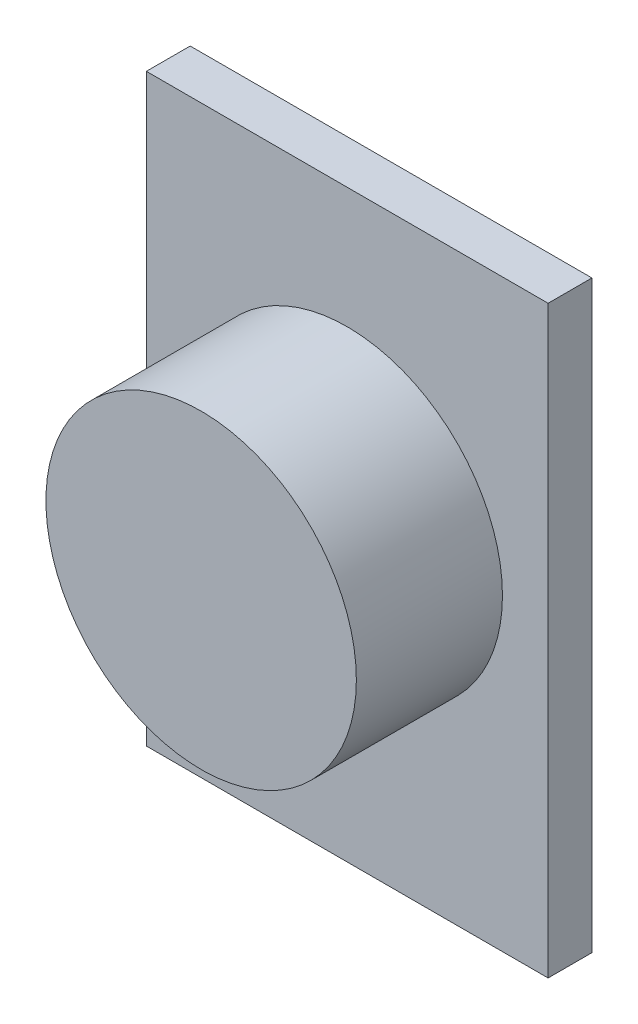
ISO-10303-21;
HEADER;
FILE_DESCRIPTION(('STEP AP214'),'2;1');
FILE_NAME('part.step','',(''),(''),'','','');
FILE_SCHEMA(('AUTOMOTIVE_DESIGN { 1 0 10303 214 1 1 1 1 }'));
ENDSEC;
DATA;
#1=APPLICATION_CONTEXT('core data for automotive mechanical design processes');
#2=APPLICATION_PROTOCOL_DEFINITION('international standard','automotive_design',2000,#1);
#3=PRODUCT_CONTEXT('',#1,'mechanical');
#4=PRODUCT('Part','Part','',(#3));
#5=PRODUCT_RELATED_PRODUCT_CATEGORY('part','',(#4));
#6=PRODUCT_DEFINITION_FORMATION('','',#4);
#7=PRODUCT_DEFINITION_CONTEXT('part definition',#1,'design');
#8=PRODUCT_DEFINITION('design','',#6,#7);
#9=PRODUCT_DEFINITION_SHAPE('','',#8);
#10=(LENGTH_UNIT() NAMED_UNIT(*) SI_UNIT(.MILLI.,.METRE.));
#11=(NAMED_UNIT(*) PLANE_ANGLE_UNIT() SI_UNIT($,.RADIAN.));
#12=(NAMED_UNIT(*) SI_UNIT($,.STERADIAN.) SOLID_ANGLE_UNIT());
#13=UNCERTAINTY_MEASURE_WITH_UNIT(LENGTH_MEASURE(1.E-05),#10,'distance_accuracy_value','');
#14=(GEOMETRIC_REPRESENTATION_CONTEXT(3) GLOBAL_UNCERTAINTY_ASSIGNED_CONTEXT((#13)) GLOBAL_UNIT_ASSIGNED_CONTEXT((#10,
#11,#12)) REPRESENTATION_CONTEXT('',''));
#15=CARTESIAN_POINT('',(0.,0.,0.));
#16=DIRECTION('',(0.,0.,1.));
#17=DIRECTION('',(1.,0.,0.));
#18=AXIS2_PLACEMENT_3D('',#15,#16,#17);
#19=CARTESIAN_POINT('',(-5.5,8.,1.2));
#20=DIRECTION('',(1.,0.,0.));
#21=DIRECTION('',(0.,0.,-1.));
#22=AXIS2_PLACEMENT_3D('',#19,#20,#21);
#23=PLANE('',#22);
#24=DIRECTION('',(0.,-1.,0.));
#25=VECTOR('',#24,1.);
#26=CARTESIAN_POINT('',(-5.5,8.,0.));
#27=LINE('',#26,#25);
#28=CARTESIAN_POINT('',(-5.5,8.,0.));
#29=VERTEX_POINT('',#28);
#30=CARTESIAN_POINT('',(-5.5,-8.,0.));
#31=VERTEX_POINT('',#30);
#32=EDGE_CURVE('E110',#29,#31,#27,.T.);
#33=ORIENTED_EDGE('',*,*,#32,.T.);
#34=DIRECTION('',(0.,0.,-1.));
#35=VECTOR('',#34,1.);
#36=CARTESIAN_POINT('',(-5.5,-8.,1.2));
#37=LINE('',#36,#35);
#38=CARTESIAN_POINT('',(-5.5,-8.,1.2));
#39=VERTEX_POINT('',#38);
#40=EDGE_CURVE('E42',#39,#31,#37,.T.);
#41=ORIENTED_EDGE('',*,*,#40,.F.);
#42=DIRECTION('',(0.,-1.,0.));
#43=VECTOR('',#42,1.);
#44=CARTESIAN_POINT('',(-5.5,8.,1.2));
#45=LINE('',#44,#43);
#46=CARTESIAN_POINT('',(-5.5,8.,1.2));
#47=VERTEX_POINT('',#46);
#48=EDGE_CURVE('E93',#47,#39,#45,.T.);
#49=ORIENTED_EDGE('',*,*,#48,.F.);
#50=DIRECTION('',(0.,0.,-1.));
#51=VECTOR('',#50,1.);
#52=CARTESIAN_POINT('',(-5.5,8.,1.2));
#53=LINE('',#52,#51);
#54=EDGE_CURVE('E106',#47,#29,#53,.T.);
#55=ORIENTED_EDGE('',*,*,#54,.T.);
#56=EDGE_LOOP('',(#33,#41,#49,#55));
#57=FACE_BOUND('',#56,.T.);
#58=ADVANCED_FACE('F39',(#57),#23,.F.);
#59=CARTESIAN_POINT('',(-5.5,-8.,1.2));
#60=DIRECTION('',(0.,1.,0.));
#61=DIRECTION('',(-1.,0.,0.));
#62=AXIS2_PLACEMENT_3D('',#59,#60,#61);
#63=PLANE('',#62);
#64=DIRECTION('',(1.,0.,0.));
#65=VECTOR('',#64,1.);
#66=CARTESIAN_POINT('',(-5.5,-8.,0.));
#67=LINE('',#66,#65);
#68=CARTESIAN_POINT('',(5.5,-8.,0.));
#69=VERTEX_POINT('',#68);
#70=EDGE_CURVE('E99',#31,#69,#67,.T.);
#71=ORIENTED_EDGE('',*,*,#70,.T.);
#72=DIRECTION('',(0.,0.,-1.));
#73=VECTOR('',#72,1.);
#74=CARTESIAN_POINT('',(5.5,-8.,1.2));
#75=LINE('',#74,#73);
#76=CARTESIAN_POINT('',(5.5,-8.,1.2));
#77=VERTEX_POINT('',#76);
#78=EDGE_CURVE('E97',#77,#69,#75,.T.);
#79=ORIENTED_EDGE('',*,*,#78,.F.);
#80=DIRECTION('',(1.,0.,0.));
#81=VECTOR('',#80,1.);
#82=CARTESIAN_POINT('',(-5.5,-8.,1.2));
#83=LINE('',#82,#81);
#84=EDGE_CURVE('E88',#39,#77,#83,.T.);
#85=ORIENTED_EDGE('',*,*,#84,.F.);
#86=ORIENTED_EDGE('',*,*,#40,.T.);
#87=EDGE_LOOP('',(#71,#79,#85,#86));
#88=FACE_BOUND('',#87,.T.);
#89=ADVANCED_FACE('F98',(#88),#63,.F.);
#90=CARTESIAN_POINT('',(5.5,8.,1.2));
#91=DIRECTION('',(-1.,0.,0.));
#92=DIRECTION('',(0.,-1.,0.));
#93=AXIS2_PLACEMENT_3D('',#90,#91,#92);
#94=PLANE('',#93);
#95=DIRECTION('',(0.,1.,0.));
#96=VECTOR('',#95,1.);
#97=CARTESIAN_POINT('',(5.5,8.,0.));
#98=LINE('',#97,#96);
#99=CARTESIAN_POINT('',(5.5,8.,0.));
#100=VERTEX_POINT('',#99);
#101=EDGE_CURVE('E74',#69,#100,#98,.T.);
#102=ORIENTED_EDGE('',*,*,#101,.T.);
#103=DIRECTION('',(0.,0.,-1.));
#104=VECTOR('',#103,1.);
#105=CARTESIAN_POINT('',(5.5,8.,1.2));
#106=LINE('',#105,#104);
#107=CARTESIAN_POINT('',(5.5,8.,1.2));
#108=VERTEX_POINT('',#107);
#109=EDGE_CURVE('E101',#108,#100,#106,.T.);
#110=ORIENTED_EDGE('',*,*,#109,.F.);
#111=DIRECTION('',(0.,1.,0.));
#112=VECTOR('',#111,1.);
#113=CARTESIAN_POINT('',(5.5,8.,1.2));
#114=LINE('',#113,#112);
#115=EDGE_CURVE('E91',#77,#108,#114,.T.);
#116=ORIENTED_EDGE('',*,*,#115,.F.);
#117=ORIENTED_EDGE('',*,*,#78,.T.);
#118=EDGE_LOOP('',(#102,#110,#116,#117));
#119=FACE_BOUND('',#118,.T.);
#120=ADVANCED_FACE('F102',(#119),#94,.F.);
#121=CARTESIAN_POINT('',(-5.5,8.,1.2));
#122=DIRECTION('',(0.,-1.,0.));
#123=DIRECTION('',(1.,0.,0.));
#124=AXIS2_PLACEMENT_3D('',#121,#122,#123);
#125=PLANE('',#124);
#126=DIRECTION('',(-1.,0.,0.));
#127=VECTOR('',#126,1.);
#128=CARTESIAN_POINT('',(-5.5,8.,0.));
#129=LINE('',#128,#127);
#130=EDGE_CURVE('E80',#100,#29,#129,.T.);
#131=ORIENTED_EDGE('',*,*,#130,.T.);
#132=ORIENTED_EDGE('',*,*,#54,.F.);
#133=DIRECTION('',(-1.,0.,0.));
#134=VECTOR('',#133,1.);
#135=CARTESIAN_POINT('',(-5.5,8.,1.2));
#136=LINE('',#135,#134);
#137=EDGE_CURVE('E57',#108,#47,#136,.T.);
#138=ORIENTED_EDGE('',*,*,#137,.F.);
#139=ORIENTED_EDGE('',*,*,#109,.T.);
#140=EDGE_LOOP('',(#131,#132,#138,#139));
#141=FACE_BOUND('',#140,.T.);
#142=ADVANCED_FACE('F124',(#141),#125,.F.);
#143=CARTESIAN_POINT('',(0.,0.,1.2));
#144=DIRECTION('',(0.,0.,1.));
#145=DIRECTION('',(1.,0.,0.));
#146=AXIS2_PLACEMENT_3D('',#143,#144,#145);
#147=PLANE('',#146);
#148=CARTESIAN_POINT('',(0.,0.443544307224284,1.2));
#149=DIRECTION('',(0.,0.,1.));
#150=DIRECTION('',(1.,0.,0.));
#151=AXIS2_PLACEMENT_3D('',#148,#149,#150);
#152=CIRCLE('',#151,4.25);
#153=CARTESIAN_POINT('',(4.25,0.443544307224284,1.2));
#154=VERTEX_POINT('',#153);
#155=EDGE_CURVE('E11',#154,#154,#152,.T.);
#156=ORIENTED_EDGE('',*,*,#155,.F.);
#157=EDGE_LOOP('',(#156));
#158=FACE_BOUND('',#157,.T.);
#159=ORIENTED_EDGE('',*,*,#48,.T.);
#160=ORIENTED_EDGE('',*,*,#84,.T.);
#161=ORIENTED_EDGE('',*,*,#115,.T.);
#162=ORIENTED_EDGE('',*,*,#137,.T.);
#163=EDGE_LOOP('',(#159,#160,#161,#162));
#164=FACE_BOUND('',#163,.T.);
#165=ADVANCED_FACE('F89',(#158,#164),#147,.T.);
#166=CARTESIAN_POINT('',(0.,0.,0.));
#167=DIRECTION('',(0.,0.,1.));
#168=DIRECTION('',(1.,0.,0.));
#169=AXIS2_PLACEMENT_3D('',#166,#167,#168);
#170=PLANE('',#169);
#171=ORIENTED_EDGE('',*,*,#32,.F.);
#172=ORIENTED_EDGE('',*,*,#130,.F.);
#173=ORIENTED_EDGE('',*,*,#101,.F.);
#174=ORIENTED_EDGE('',*,*,#70,.F.);
#175=EDGE_LOOP('',(#171,#172,#173,#174));
#176=FACE_BOUND('',#175,.T.);
#177=ADVANCED_FACE('F127',(#176),#170,.F.);
#178=CARTESIAN_POINT('',(0.,0.443544307224284,5.2));
#179=DIRECTION('',(0.,0.,-1.));
#180=DIRECTION('',(-1.,0.,0.));
#181=AXIS2_PLACEMENT_3D('',#178,#179,#180);
#182=CYLINDRICAL_SURFACE('',#181,4.25);
#183=CARTESIAN_POINT('',(0.,0.443544307224284,5.2));
#184=DIRECTION('',(0.,0.,1.));
#185=DIRECTION('',(1.,0.,0.));
#186=AXIS2_PLACEMENT_3D('',#183,#184,#185);
#187=CIRCLE('',#186,4.25);
#188=CARTESIAN_POINT('',(4.25,0.443544307224284,5.2));
#189=VERTEX_POINT('',#188);
#190=EDGE_CURVE('E114',#189,#189,#187,.T.);
#191=ORIENTED_EDGE('',*,*,#190,.F.);
#192=EDGE_LOOP('',(#191));
#193=FACE_BOUND('',#192,.T.);
#194=ORIENTED_EDGE('',*,*,#155,.T.);
#195=EDGE_LOOP('',(#194));
#196=FACE_BOUND('',#195,.T.);
#197=ADVANCED_FACE('F137',(#193,#196),#182,.T.);
#198=CARTESIAN_POINT('',(0.,0.443544307224284,5.2));
#199=DIRECTION('',(0.,0.,1.));
#200=DIRECTION('',(1.,0.,0.));
#201=AXIS2_PLACEMENT_3D('',#198,#199,#200);
#202=PLANE('',#201);
#203=ORIENTED_EDGE('',*,*,#190,.T.);
#204=EDGE_LOOP('',(#203));
#205=FACE_BOUND('',#204,.T.);
#206=ADVANCED_FACE('F135',(#205),#202,.T.);
#207=CLOSED_SHELL('',(#58,#89,#120,#142,#165,#177,#197,#206));
#208=MANIFOLD_SOLID_BREP('B2',#207);
#209=ADVANCED_BREP_SHAPE_REPRESENTATION('',(#18,#208),#14);
#210=SHAPE_DEFINITION_REPRESENTATION(#9,#209);
ENDSEC;
END-ISO-10303-21;
